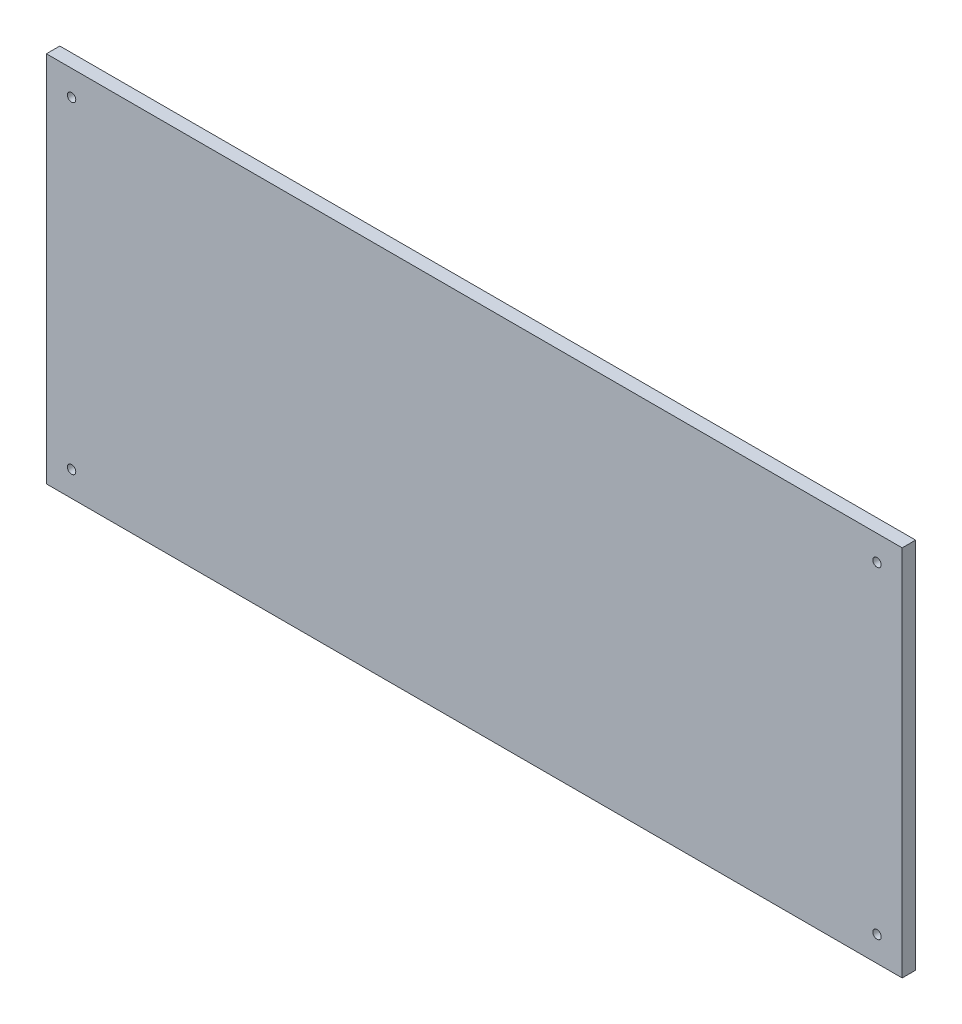
ISO-10303-21;
HEADER;
FILE_DESCRIPTION(('STEP AP214'),'2;1');
FILE_NAME('part.step','',(''),(''),'','','');
FILE_SCHEMA(('AUTOMOTIVE_DESIGN { 1 0 10303 214 1 1 1 1 }'));
ENDSEC;
DATA;
#1=APPLICATION_CONTEXT('core data for automotive mechanical design processes');
#2=APPLICATION_PROTOCOL_DEFINITION('international standard','automotive_design',2000,#1);
#3=PRODUCT_CONTEXT('',#1,'mechanical');
#4=PRODUCT('Part','Part','',(#3));
#5=PRODUCT_RELATED_PRODUCT_CATEGORY('part','',(#4));
#6=PRODUCT_DEFINITION_FORMATION('','',#4);
#7=PRODUCT_DEFINITION_CONTEXT('part definition',#1,'design');
#8=PRODUCT_DEFINITION('design','',#6,#7);
#9=PRODUCT_DEFINITION_SHAPE('','',#8);
#10=(LENGTH_UNIT() NAMED_UNIT(*) SI_UNIT(.MILLI.,.METRE.));
#11=(NAMED_UNIT(*) PLANE_ANGLE_UNIT() SI_UNIT($,.RADIAN.));
#12=(NAMED_UNIT(*) SI_UNIT($,.STERADIAN.) SOLID_ANGLE_UNIT());
#13=UNCERTAINTY_MEASURE_WITH_UNIT(LENGTH_MEASURE(1.E-05),#10,'distance_accuracy_value','');
#14=(GEOMETRIC_REPRESENTATION_CONTEXT(3) GLOBAL_UNCERTAINTY_ASSIGNED_CONTEXT((#13)) GLOBAL_UNIT_ASSIGNED_CONTEXT((#10,
#11,#12)) REPRESENTATION_CONTEXT('',''));
#15=CARTESIAN_POINT('',(0.,0.,0.));
#16=DIRECTION('',(0.,0.,1.));
#17=DIRECTION('',(1.,0.,0.));
#18=AXIS2_PLACEMENT_3D('',#15,#16,#17);
#19=CARTESIAN_POINT('',(0.,0.,243.205));
#20=DIRECTION('',(0.,0.,-1.));
#21=DIRECTION('',(-1.,0.,0.));
#22=AXIS2_PLACEMENT_3D('',#19,#20,#21);
#23=PLANE('',#22);
#24=DIRECTION('',(0.,1.,0.));
#25=VECTOR('',#24,1.);
#26=CARTESIAN_POINT('',(161.925,-152.4,243.205));
#27=LINE('',#26,#25);
#28=CARTESIAN_POINT('',(161.925,-152.4,243.205));
#29=VERTEX_POINT('',#28);
#30=CARTESIAN_POINT('',(161.925,-11.4299999999999,243.205));
#31=VERTEX_POINT('',#30);
#32=EDGE_CURVE('E85',#29,#31,#27,.T.);
#33=ORIENTED_EDGE('',*,*,#32,.T.);
#34=DIRECTION('',(-1.,0.,0.));
#35=VECTOR('',#34,1.);
#36=CARTESIAN_POINT('',(-161.925,-11.4299999999999,243.205));
#37=LINE('',#36,#35);
#38=CARTESIAN_POINT('',(-161.925,-11.4299999999999,243.205));
#39=VERTEX_POINT('',#38);
#40=EDGE_CURVE('E80',#31,#39,#37,.T.);
#41=ORIENTED_EDGE('',*,*,#40,.T.);
#42=DIRECTION('',(0.,-1.,0.));
#43=VECTOR('',#42,1.);
#44=CARTESIAN_POINT('',(-161.925,-152.4,243.205));
#45=LINE('',#44,#43);
#46=CARTESIAN_POINT('',(-161.925,-152.4,243.205));
#47=VERTEX_POINT('',#46);
#48=EDGE_CURVE('E83',#39,#47,#45,.T.);
#49=ORIENTED_EDGE('',*,*,#48,.T.);
#50=DIRECTION('',(1.,0.,0.));
#51=VECTOR('',#50,1.);
#52=CARTESIAN_POINT('',(-161.925,-152.4,243.205));
#53=LINE('',#52,#51);
#54=EDGE_CURVE('E50',#47,#29,#53,.T.);
#55=ORIENTED_EDGE('',*,*,#54,.T.);
#56=EDGE_LOOP('',(#33,#41,#49,#55));
#57=FACE_BOUND('',#56,.T.);
#58=CARTESIAN_POINT('',(-152.4,-20.9549999999999,243.205));
#59=DIRECTION('',(0.,0.,1.));
#60=DIRECTION('',(1.,0.,0.));
#61=AXIS2_PLACEMENT_3D('',#58,#59,#60);
#62=CIRCLE('',#61,1.58749999999999);
#63=CARTESIAN_POINT('',(-150.8125,-20.9549999999999,243.205));
#64=VERTEX_POINT('',#63);
#65=EDGE_CURVE('E100',#64,#64,#62,.T.);
#66=ORIENTED_EDGE('',*,*,#65,.F.);
#67=EDGE_LOOP('',(#66));
#68=FACE_BOUND('',#67,.T.);
#69=CARTESIAN_POINT('',(152.4,-20.9549999999999,243.205));
#70=DIRECTION('',(0.,0.,1.));
#71=DIRECTION('',(1.,0.,0.));
#72=AXIS2_PLACEMENT_3D('',#69,#70,#71);
#73=CIRCLE('',#72,1.58750000000123);
#74=CARTESIAN_POINT('',(153.987500000001,-20.9549999999999,243.205));
#75=VERTEX_POINT('',#74);
#76=EDGE_CURVE('E115',#75,#75,#73,.T.);
#77=ORIENTED_EDGE('',*,*,#76,.F.);
#78=EDGE_LOOP('',(#77));
#79=FACE_BOUND('',#78,.T.);
#80=CARTESIAN_POINT('',(152.4,-142.875,243.205));
#81=DIRECTION('',(0.,0.,1.));
#82=DIRECTION('',(1.,0.,0.));
#83=AXIS2_PLACEMENT_3D('',#80,#81,#82);
#84=CIRCLE('',#83,1.58750000000288);
#85=CARTESIAN_POINT('',(153.987500000003,-142.875,243.205));
#86=VERTEX_POINT('',#85);
#87=EDGE_CURVE('E121',#86,#86,#84,.T.);
#88=ORIENTED_EDGE('',*,*,#87,.F.);
#89=EDGE_LOOP('',(#88));
#90=FACE_BOUND('',#89,.T.);
#91=CARTESIAN_POINT('',(-152.399999999998,-142.875,243.205));
#92=DIRECTION('',(0.,0.,1.));
#93=DIRECTION('',(1.,0.,0.));
#94=AXIS2_PLACEMENT_3D('',#91,#92,#93);
#95=CIRCLE('',#94,1.58749999999999);
#96=CARTESIAN_POINT('',(-150.812499999998,-142.875,243.205));
#97=VERTEX_POINT('',#96);
#98=EDGE_CURVE('E127',#97,#97,#95,.T.);
#99=ORIENTED_EDGE('',*,*,#98,.F.);
#100=EDGE_LOOP('',(#99));
#101=FACE_BOUND('',#100,.T.);
#102=ADVANCED_FACE('F33',(#57,#68,#79,#90,#101),#23,.F.);
#103=CARTESIAN_POINT('',(0.,0.,238.125));
#104=DIRECTION('',(0.,0.,-1.));
#105=DIRECTION('',(-1.,0.,0.));
#106=AXIS2_PLACEMENT_3D('',#103,#104,#105);
#107=PLANE('',#106);
#108=CARTESIAN_POINT('',(152.4,-142.875,238.125));
#109=DIRECTION('',(0.,0.,1.));
#110=DIRECTION('',(1.,0.,0.));
#111=AXIS2_PLACEMENT_3D('',#108,#109,#110);
#112=CIRCLE('',#111,1.58750000000288);
#113=CARTESIAN_POINT('',(153.987500000003,-142.875,238.125));
#114=VERTEX_POINT('',#113);
#115=EDGE_CURVE('E124',#114,#114,#112,.T.);
#116=ORIENTED_EDGE('',*,*,#115,.T.);
#117=EDGE_LOOP('',(#116));
#118=FACE_BOUND('',#117,.T.);
#119=CARTESIAN_POINT('',(-152.4,-20.9549999999999,238.125));
#120=DIRECTION('',(0.,0.,1.));
#121=DIRECTION('',(1.,0.,0.));
#122=AXIS2_PLACEMENT_3D('',#119,#120,#121);
#123=CIRCLE('',#122,1.58749999999999);
#124=CARTESIAN_POINT('',(-150.8125,-20.9549999999999,238.125));
#125=VERTEX_POINT('',#124);
#126=EDGE_CURVE('E112',#125,#125,#123,.T.);
#127=ORIENTED_EDGE('',*,*,#126,.T.);
#128=EDGE_LOOP('',(#127));
#129=FACE_BOUND('',#128,.T.);
#130=DIRECTION('',(0.,1.,0.));
#131=VECTOR('',#130,1.);
#132=CARTESIAN_POINT('',(161.925,-152.4,238.125));
#133=LINE('',#132,#131);
#134=CARTESIAN_POINT('',(161.925,-152.4,238.125));
#135=VERTEX_POINT('',#134);
#136=CARTESIAN_POINT('',(161.925,-11.4299999999999,238.125));
#137=VERTEX_POINT('',#136);
#138=EDGE_CURVE('E97',#135,#137,#133,.T.);
#139=ORIENTED_EDGE('',*,*,#138,.F.);
#140=DIRECTION('',(1.,0.,0.));
#141=VECTOR('',#140,1.);
#142=CARTESIAN_POINT('',(-161.925,-152.4,238.125));
#143=LINE('',#142,#141);
#144=CARTESIAN_POINT('',(-161.925,-152.4,238.125));
#145=VERTEX_POINT('',#144);
#146=EDGE_CURVE('E73',#145,#135,#143,.T.);
#147=ORIENTED_EDGE('',*,*,#146,.F.);
#148=DIRECTION('',(0.,-1.,0.));
#149=VECTOR('',#148,1.);
#150=CARTESIAN_POINT('',(-161.925,-152.4,238.125));
#151=LINE('',#150,#149);
#152=CARTESIAN_POINT('',(-161.925,-11.4299999999999,238.125));
#153=VERTEX_POINT('',#152);
#154=EDGE_CURVE('E67',#153,#145,#151,.T.);
#155=ORIENTED_EDGE('',*,*,#154,.F.);
#156=DIRECTION('',(-1.,0.,0.));
#157=VECTOR('',#156,1.);
#158=CARTESIAN_POINT('',(-161.925,-11.4299999999999,238.125));
#159=LINE('',#158,#157);
#160=EDGE_CURVE('E89',#137,#153,#159,.T.);
#161=ORIENTED_EDGE('',*,*,#160,.F.);
#162=EDGE_LOOP('',(#139,#147,#155,#161));
#163=FACE_BOUND('',#162,.T.);
#164=CARTESIAN_POINT('',(152.4,-20.9549999999999,238.125));
#165=DIRECTION('',(0.,0.,1.));
#166=DIRECTION('',(1.,0.,0.));
#167=AXIS2_PLACEMENT_3D('',#164,#165,#166);
#168=CIRCLE('',#167,1.58750000000123);
#169=CARTESIAN_POINT('',(153.987500000001,-20.9549999999999,238.125));
#170=VERTEX_POINT('',#169);
#171=EDGE_CURVE('E118',#170,#170,#168,.T.);
#172=ORIENTED_EDGE('',*,*,#171,.T.);
#173=EDGE_LOOP('',(#172));
#174=FACE_BOUND('',#173,.T.);
#175=CARTESIAN_POINT('',(-152.399999999998,-142.875,238.125));
#176=DIRECTION('',(0.,0.,1.));
#177=DIRECTION('',(1.,0.,0.));
#178=AXIS2_PLACEMENT_3D('',#175,#176,#177);
#179=CIRCLE('',#178,1.58749999999999);
#180=CARTESIAN_POINT('',(-150.812499999998,-142.875,238.125));
#181=VERTEX_POINT('',#180);
#182=EDGE_CURVE('E130',#181,#181,#179,.T.);
#183=ORIENTED_EDGE('',*,*,#182,.T.);
#184=EDGE_LOOP('',(#183));
#185=FACE_BOUND('',#184,.T.);
#186=ADVANCED_FACE('F108',(#118,#129,#163,#174,#185),#107,.T.);
#187=CARTESIAN_POINT('',(161.925,-152.4,243.205));
#188=DIRECTION('',(-1.,0.,0.));
#189=DIRECTION('',(0.,0.,1.));
#190=AXIS2_PLACEMENT_3D('',#187,#188,#189);
#191=PLANE('',#190);
#192=ORIENTED_EDGE('',*,*,#138,.T.);
#193=DIRECTION('',(0.,0.,-1.));
#194=VECTOR('',#193,1.);
#195=CARTESIAN_POINT('',(161.925,-11.4299999999999,243.205));
#196=LINE('',#195,#194);
#197=EDGE_CURVE('E11',#31,#137,#196,.T.);
#198=ORIENTED_EDGE('',*,*,#197,.F.);
#199=ORIENTED_EDGE('',*,*,#32,.F.);
#200=DIRECTION('',(0.,0.,-1.));
#201=VECTOR('',#200,1.);
#202=CARTESIAN_POINT('',(161.925,-152.4,243.205));
#203=LINE('',#202,#201);
#204=EDGE_CURVE('E93',#29,#135,#203,.T.);
#205=ORIENTED_EDGE('',*,*,#204,.T.);
#206=EDGE_LOOP('',(#192,#198,#199,#205));
#207=FACE_BOUND('',#206,.T.);
#208=ADVANCED_FACE('F35',(#207),#191,.F.);
#209=CARTESIAN_POINT('',(-161.925,-11.4299999999999,243.205));
#210=DIRECTION('',(0.,-1.,0.));
#211=DIRECTION('',(0.,0.,-1.));
#212=AXIS2_PLACEMENT_3D('',#209,#210,#211);
#213=PLANE('',#212);
#214=ORIENTED_EDGE('',*,*,#160,.T.);
#215=DIRECTION('',(0.,0.,-1.));
#216=VECTOR('',#215,1.);
#217=CARTESIAN_POINT('',(-161.925,-11.4299999999999,243.205));
#218=LINE('',#217,#216);
#219=EDGE_CURVE('E42',#39,#153,#218,.T.);
#220=ORIENTED_EDGE('',*,*,#219,.F.);
#221=ORIENTED_EDGE('',*,*,#40,.F.);
#222=ORIENTED_EDGE('',*,*,#197,.T.);
#223=EDGE_LOOP('',(#214,#220,#221,#222));
#224=FACE_BOUND('',#223,.T.);
#225=ADVANCED_FACE('F88',(#224),#213,.F.);
#226=CARTESIAN_POINT('',(-161.925,-152.4,243.205));
#227=DIRECTION('',(1.,0.,0.));
#228=DIRECTION('',(0.,0.,-1.));
#229=AXIS2_PLACEMENT_3D('',#226,#227,#228);
#230=PLANE('',#229);
#231=ORIENTED_EDGE('',*,*,#154,.T.);
#232=DIRECTION('',(0.,0.,-1.));
#233=VECTOR('',#232,1.);
#234=CARTESIAN_POINT('',(-161.925,-152.4,243.205));
#235=LINE('',#234,#233);
#236=EDGE_CURVE('E90',#47,#145,#235,.T.);
#237=ORIENTED_EDGE('',*,*,#236,.F.);
#238=ORIENTED_EDGE('',*,*,#48,.F.);
#239=ORIENTED_EDGE('',*,*,#219,.T.);
#240=EDGE_LOOP('',(#231,#237,#238,#239));
#241=FACE_BOUND('',#240,.T.);
#242=ADVANCED_FACE('F91',(#241),#230,.F.);
#243=CARTESIAN_POINT('',(-161.925,-152.4,243.205));
#244=DIRECTION('',(0.,1.,0.));
#245=DIRECTION('',(0.,0.,1.));
#246=AXIS2_PLACEMENT_3D('',#243,#244,#245);
#247=PLANE('',#246);
#248=ORIENTED_EDGE('',*,*,#146,.T.);
#249=ORIENTED_EDGE('',*,*,#204,.F.);
#250=ORIENTED_EDGE('',*,*,#54,.F.);
#251=ORIENTED_EDGE('',*,*,#236,.T.);
#252=EDGE_LOOP('',(#248,#249,#250,#251));
#253=FACE_BOUND('',#252,.T.);
#254=ADVANCED_FACE('F105',(#253),#247,.F.);
#255=CARTESIAN_POINT('',(-152.4,-20.9549999999999,243.205));
#256=DIRECTION('',(0.,0.,-1.));
#257=DIRECTION('',(-1.,0.,0.));
#258=AXIS2_PLACEMENT_3D('',#255,#256,#257);
#259=CYLINDRICAL_SURFACE('',#258,1.58749999999999);
#260=ORIENTED_EDGE('',*,*,#65,.T.);
#261=EDGE_LOOP('',(#260));
#262=FACE_BOUND('',#261,.T.);
#263=ORIENTED_EDGE('',*,*,#126,.F.);
#264=EDGE_LOOP('',(#263));
#265=FACE_BOUND('',#264,.T.);
#266=ADVANCED_FACE('F147',(#262,#265),#259,.F.);
#267=CARTESIAN_POINT('',(152.4,-20.9549999999999,243.205));
#268=DIRECTION('',(0.,0.,-1.));
#269=DIRECTION('',(-1.,0.,0.));
#270=AXIS2_PLACEMENT_3D('',#267,#268,#269);
#271=CYLINDRICAL_SURFACE('',#270,1.58750000000123);
#272=ORIENTED_EDGE('',*,*,#76,.T.);
#273=EDGE_LOOP('',(#272));
#274=FACE_BOUND('',#273,.T.);
#275=ORIENTED_EDGE('',*,*,#171,.F.);
#276=EDGE_LOOP('',(#275));
#277=FACE_BOUND('',#276,.T.);
#278=ADVANCED_FACE('F192',(#274,#277),#271,.F.);
#279=CARTESIAN_POINT('',(152.4,-142.875,243.205));
#280=DIRECTION('',(0.,0.,-1.));
#281=DIRECTION('',(-1.,0.,0.));
#282=AXIS2_PLACEMENT_3D('',#279,#280,#281);
#283=CYLINDRICAL_SURFACE('',#282,1.58750000000288);
#284=ORIENTED_EDGE('',*,*,#87,.T.);
#285=EDGE_LOOP('',(#284));
#286=FACE_BOUND('',#285,.T.);
#287=ORIENTED_EDGE('',*,*,#115,.F.);
#288=EDGE_LOOP('',(#287));
#289=FACE_BOUND('',#288,.T.);
#290=ADVANCED_FACE('F200',(#286,#289),#283,.F.);
#291=CARTESIAN_POINT('',(-152.399999999998,-142.875,243.205));
#292=DIRECTION('',(0.,0.,-1.));
#293=DIRECTION('',(-1.,0.,0.));
#294=AXIS2_PLACEMENT_3D('',#291,#292,#293);
#295=CYLINDRICAL_SURFACE('',#294,1.58749999999999);
#296=ORIENTED_EDGE('',*,*,#98,.T.);
#297=EDGE_LOOP('',(#296));
#298=FACE_BOUND('',#297,.T.);
#299=ORIENTED_EDGE('',*,*,#182,.F.);
#300=EDGE_LOOP('',(#299));
#301=FACE_BOUND('',#300,.T.);
#302=ADVANCED_FACE('F136',(#298,#301),#295,.F.);
#303=CLOSED_SHELL('',(#102,#186,#208,#225,#242,#254,#266,#278,#290,#302));
#304=MANIFOLD_SOLID_BREP('B2',#303);
#305=ADVANCED_BREP_SHAPE_REPRESENTATION('',(#18,#304),#14);
#306=SHAPE_DEFINITION_REPRESENTATION(#9,#305);
ENDSEC;
END-ISO-10303-21;
